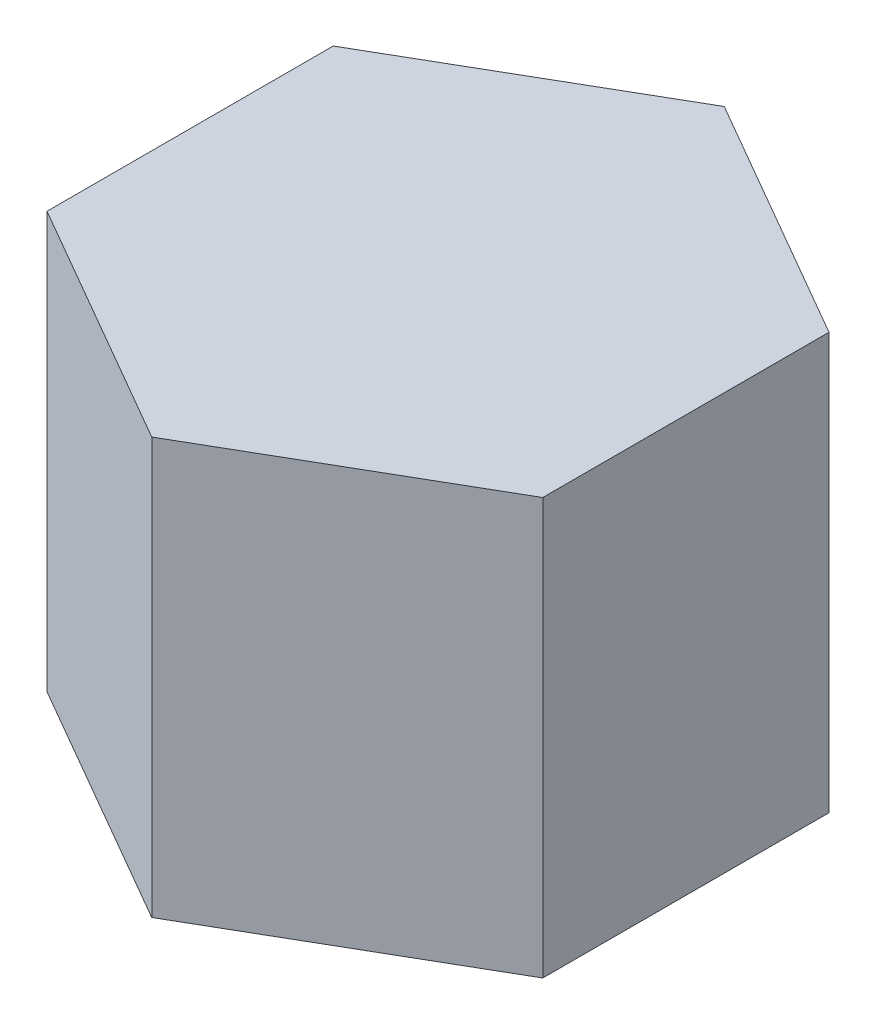
ISO-10303-21;
HEADER;
FILE_DESCRIPTION(('STEP AP214'),'2;1');
FILE_NAME('part.step','',(''),(''),'','','');
FILE_SCHEMA(('AUTOMOTIVE_DESIGN { 1 0 10303 214 1 1 1 1 }'));
ENDSEC;
DATA;
#1=APPLICATION_CONTEXT('core data for automotive mechanical design processes');
#2=APPLICATION_PROTOCOL_DEFINITION('international standard','automotive_design',2000,#1);
#3=PRODUCT_CONTEXT('',#1,'mechanical');
#4=PRODUCT('Part','Part','',(#3));
#5=PRODUCT_RELATED_PRODUCT_CATEGORY('part','',(#4));
#6=PRODUCT_DEFINITION_FORMATION('','',#4);
#7=PRODUCT_DEFINITION_CONTEXT('part definition',#1,'design');
#8=PRODUCT_DEFINITION('design','',#6,#7);
#9=PRODUCT_DEFINITION_SHAPE('','',#8);
#10=(LENGTH_UNIT() NAMED_UNIT(*) SI_UNIT(.MILLI.,.METRE.));
#11=(NAMED_UNIT(*) PLANE_ANGLE_UNIT() SI_UNIT($,.RADIAN.));
#12=(NAMED_UNIT(*) SI_UNIT($,.STERADIAN.) SOLID_ANGLE_UNIT());
#13=UNCERTAINTY_MEASURE_WITH_UNIT(LENGTH_MEASURE(1.E-05),#10,'distance_accuracy_value','');
#14=(GEOMETRIC_REPRESENTATION_CONTEXT(3) GLOBAL_UNCERTAINTY_ASSIGNED_CONTEXT((#13)) GLOBAL_UNIT_ASSIGNED_CONTEXT((#10,
#11,#12)) REPRESENTATION_CONTEXT('',''));
#15=CARTESIAN_POINT('',(0.,0.,0.));
#16=DIRECTION('',(0.,0.,1.));
#17=DIRECTION('',(1.,0.,0.));
#18=AXIS2_PLACEMENT_3D('',#15,#16,#17);
#19=CARTESIAN_POINT('',(204.339551417382,-147.556598747966,291.681971220494));
#20=DIRECTION('',(-0.500000000000096,0.,-0.866025403784383));
#21=DIRECTION('',(-0.866025403784383,0.,0.500000000000096));
#22=AXIS2_PLACEMENT_3D('',#19,#20,#21);
#23=PLANE('',#22);
#24=CARTESIAN_POINT('',(204.642660308706,-147.047793579175,291.506971220494));
#25=DIRECTION('',(-0.866025403784383,0.,0.500000000000096));
#26=VECTOR('',#25,1.);
#27=LINE('',#24,#26);
#28=CARTESIAN_POINT('',(204.642660308706,-147.047793579175,291.506971220494));
#29=VERTEX_POINT('',#28);
#30=CARTESIAN_POINT('',(204.339551417382,-147.047793579175,291.681971220494));
#31=VERTEX_POINT('',#30);
#32=EDGE_CURVE('E170',#29,#31,#27,.T.);
#33=ORIENTED_EDGE('',*,*,#32,.T.);
#34=CARTESIAN_POINT('',(204.339551417382,-147.556598747966,291.681971220494));
#35=DIRECTION('',(0.,1.,0.));
#36=VECTOR('',#35,1.);
#37=LINE('',#34,#36);
#38=CARTESIAN_POINT('',(204.339551417382,-147.556598747966,291.681971220494));
#39=VERTEX_POINT('',#38);
#40=EDGE_CURVE('E35',#39,#31,#37,.T.);
#41=ORIENTED_EDGE('',*,*,#40,.F.);
#42=CARTESIAN_POINT('',(204.642660308706,-147.556598747966,291.506971220494));
#43=DIRECTION('',(-0.866025403784383,0.,0.500000000000096));
#44=VECTOR('',#43,1.);
#45=LINE('',#42,#44);
#46=CARTESIAN_POINT('',(204.642660308706,-147.556598747966,291.506971220494));
#47=VERTEX_POINT('',#46);
#48=EDGE_CURVE('E159',#47,#39,#45,.T.);
#49=ORIENTED_EDGE('',*,*,#48,.F.);
#50=CARTESIAN_POINT('',(204.642660308706,-147.556598747966,291.506971220494));
#51=DIRECTION('',(0.,1.,0.));
#52=VECTOR('',#51,1.);
#53=LINE('',#50,#52);
#54=EDGE_CURVE('E10',#47,#29,#53,.T.);
#55=ORIENTED_EDGE('',*,*,#54,.T.);
#56=EDGE_LOOP('',(#33,#41,#49,#55));
#57=FACE_BOUND('',#56,.T.);
#58=ADVANCED_FACE('F16',(#57),#23,.F.);
#59=CARTESIAN_POINT('',(204.642660308706,-147.556598747966,291.594471220494));
#60=DIRECTION('',(-1.,0.,0.));
#61=DIRECTION('',(0.,-1.,0.));
#62=AXIS2_PLACEMENT_3D('',#59,#60,#61);
#63=PLANE('',#62);
#64=CARTESIAN_POINT('',(204.642660308706,-147.047793579175,291.156971220494));
#65=DIRECTION('',(0.,0.,1.));
#66=VECTOR('',#65,1.);
#67=LINE('',#64,#66);
#68=CARTESIAN_POINT('',(204.642660308706,-147.047793579175,291.156971220494));
#69=VERTEX_POINT('',#68);
#70=EDGE_CURVE('E167',#69,#29,#67,.T.);
#71=ORIENTED_EDGE('',*,*,#70,.T.);
#72=ORIENTED_EDGE('',*,*,#54,.F.);
#73=CARTESIAN_POINT('',(204.642660308706,-147.556598747966,291.156971220494));
#74=DIRECTION('',(0.,0.,1.));
#75=VECTOR('',#74,1.);
#76=LINE('',#73,#75);
#77=CARTESIAN_POINT('',(204.642660308706,-147.556598747966,291.156971220494));
#78=VERTEX_POINT('',#77);
#79=EDGE_CURVE('E156',#78,#47,#76,.T.);
#80=ORIENTED_EDGE('',*,*,#79,.F.);
#81=CARTESIAN_POINT('',(204.642660308706,-147.556598747966,291.156971220494));
#82=DIRECTION('',(0.,1.,0.));
#83=VECTOR('',#82,1.);
#84=LINE('',#81,#83);
#85=EDGE_CURVE('E27',#78,#69,#84,.T.);
#86=ORIENTED_EDGE('',*,*,#85,.T.);
#87=EDGE_LOOP('',(#71,#72,#80,#86));
#88=FACE_BOUND('',#87,.T.);
#89=ADVANCED_FACE('F189',(#88),#63,.F.);
#90=CARTESIAN_POINT('',(204.642660308706,-147.556598747966,291.156971220494));
#91=DIRECTION('',(-0.500000000000062,0.,0.866025403784403));
#92=DIRECTION('',(0.866025403784403,0.,0.500000000000062));
#93=AXIS2_PLACEMENT_3D('',#90,#91,#92);
#94=PLANE('',#93);
#95=CARTESIAN_POINT('',(204.339551417381,-147.047793579175,290.981971220494));
#96=DIRECTION('',(0.866025403784403,0.,0.500000000000062));
#97=VECTOR('',#96,1.);
#98=LINE('',#95,#97);
#99=CARTESIAN_POINT('',(204.339551417382,-147.047793579175,290.981971220494));
#100=VERTEX_POINT('',#99);
#101=EDGE_CURVE('E163',#100,#69,#98,.T.);
#102=ORIENTED_EDGE('',*,*,#101,.T.);
#103=ORIENTED_EDGE('',*,*,#85,.F.);
#104=CARTESIAN_POINT('',(204.339551417381,-147.556598747966,290.981971220494));
#105=DIRECTION('',(0.866025403784403,0.,0.500000000000062));
#106=VECTOR('',#105,1.);
#107=LINE('',#104,#106);
#108=CARTESIAN_POINT('',(204.339551417382,-147.556598747966,290.981971220494));
#109=VERTEX_POINT('',#108);
#110=EDGE_CURVE('E106',#109,#78,#107,.T.);
#111=ORIENTED_EDGE('',*,*,#110,.F.);
#112=CARTESIAN_POINT('',(204.339551417381,-147.556598747966,290.981971220494));
#113=DIRECTION('',(0.,1.,0.));
#114=VECTOR('',#113,1.);
#115=LINE('',#112,#114);
#116=EDGE_CURVE('E94',#109,#100,#115,.T.);
#117=ORIENTED_EDGE('',*,*,#116,.T.);
#118=EDGE_LOOP('',(#102,#103,#111,#117));
#119=FACE_BOUND('',#118,.T.);
#120=ADVANCED_FACE('F198',(#119),#94,.F.);
#121=CARTESIAN_POINT('',(204.339551417382,-147.556598747966,290.981971220494));
#122=DIRECTION('',(0.500000000000062,0.,0.866025403784403));
#123=DIRECTION('',(0.866025403784403,0.,-0.500000000000062));
#124=AXIS2_PLACEMENT_3D('',#121,#122,#123);
#125=PLANE('',#124);
#126=CARTESIAN_POINT('',(204.036442526057,-147.047793579175,291.156971220494));
#127=DIRECTION('',(0.866025403784403,0.,-0.500000000000062));
#128=VECTOR('',#127,1.);
#129=LINE('',#126,#128);
#130=CARTESIAN_POINT('',(204.036442526057,-147.047793579175,291.156971220494));
#131=VERTEX_POINT('',#130);
#132=EDGE_CURVE('E162',#131,#100,#129,.T.);
#133=ORIENTED_EDGE('',*,*,#132,.T.);
#134=ORIENTED_EDGE('',*,*,#116,.F.);
#135=CARTESIAN_POINT('',(204.036442526057,-147.556598747966,291.156971220494));
#136=DIRECTION('',(0.866025403784403,0.,-0.500000000000062));
#137=VECTOR('',#136,1.);
#138=LINE('',#135,#137);
#139=CARTESIAN_POINT('',(204.036442526057,-147.556598747966,291.156971220494));
#140=VERTEX_POINT('',#139);
#141=EDGE_CURVE('E98',#140,#109,#138,.T.);
#142=ORIENTED_EDGE('',*,*,#141,.F.);
#143=CARTESIAN_POINT('',(204.036442526057,-147.556598747966,291.156971220494));
#144=DIRECTION('',(0.,1.,0.));
#145=VECTOR('',#144,1.);
#146=LINE('',#143,#145);
#147=EDGE_CURVE('E79',#140,#131,#146,.T.);
#148=ORIENTED_EDGE('',*,*,#147,.T.);
#149=EDGE_LOOP('',(#133,#134,#142,#148));
#150=FACE_BOUND('',#149,.T.);
#151=ADVANCED_FACE('F100',(#150),#125,.F.);
#152=CARTESIAN_POINT('',(204.036442526057,-147.556598747966,291.594471220494));
#153=DIRECTION('',(1.,0.,0.));
#154=DIRECTION('',(0.,1.,0.));
#155=AXIS2_PLACEMENT_3D('',#152,#153,#154);
#156=PLANE('',#155);
#157=CARTESIAN_POINT('',(204.036442526057,-147.047793579175,291.506971220494));
#158=DIRECTION('',(0.,0.,-1.));
#159=VECTOR('',#158,1.);
#160=LINE('',#157,#159);
#161=CARTESIAN_POINT('',(204.036442526057,-147.047793579175,291.506971220494));
#162=VERTEX_POINT('',#161);
#163=EDGE_CURVE('E88',#162,#131,#160,.T.);
#164=ORIENTED_EDGE('',*,*,#163,.T.);
#165=ORIENTED_EDGE('',*,*,#147,.F.);
#166=CARTESIAN_POINT('',(204.036442526057,-147.556598747966,291.506971220494));
#167=DIRECTION('',(0.,0.,-1.));
#168=VECTOR('',#167,1.);
#169=LINE('',#166,#168);
#170=CARTESIAN_POINT('',(204.036442526057,-147.556598747966,291.506971220494));
#171=VERTEX_POINT('',#170);
#172=EDGE_CURVE('E84',#171,#140,#169,.T.);
#173=ORIENTED_EDGE('',*,*,#172,.F.);
#174=CARTESIAN_POINT('',(204.036442526057,-147.556598747966,291.506971220494));
#175=DIRECTION('',(0.,1.,0.));
#176=VECTOR('',#175,1.);
#177=LINE('',#174,#176);
#178=EDGE_CURVE('E58',#171,#162,#177,.T.);
#179=ORIENTED_EDGE('',*,*,#178,.T.);
#180=EDGE_LOOP('',(#164,#165,#173,#179));
#181=FACE_BOUND('',#180,.T.);
#182=ADVANCED_FACE('F82',(#181),#156,.F.);
#183=CARTESIAN_POINT('',(204.036442526057,-147.556598747966,291.506971220494));
#184=DIRECTION('',(0.500000000000062,0.,-0.866025403784403));
#185=DIRECTION('',(-0.866025403784403,0.,-0.500000000000062));
#186=AXIS2_PLACEMENT_3D('',#183,#184,#185);
#187=PLANE('',#186);
#188=CARTESIAN_POINT('',(204.339551417382,-147.047793579175,291.681971220494));
#189=DIRECTION('',(-0.866025403784403,0.,-0.500000000000062));
#190=VECTOR('',#189,1.);
#191=LINE('',#188,#190);
#192=EDGE_CURVE('E160',#31,#162,#191,.T.);
#193=ORIENTED_EDGE('',*,*,#192,.T.);
#194=ORIENTED_EDGE('',*,*,#178,.F.);
#195=CARTESIAN_POINT('',(204.339551417382,-147.556598747966,291.681971220494));
#196=DIRECTION('',(-0.866025403784403,0.,-0.500000000000062));
#197=VECTOR('',#196,1.);
#198=LINE('',#195,#197);
#199=EDGE_CURVE('E112',#39,#171,#198,.T.);
#200=ORIENTED_EDGE('',*,*,#199,.F.);
#201=ORIENTED_EDGE('',*,*,#40,.T.);
#202=EDGE_LOOP('',(#193,#194,#200,#201));
#203=FACE_BOUND('',#202,.T.);
#204=ADVANCED_FACE('F131',(#203),#187,.F.);
#205=CARTESIAN_POINT('',(206.491105863044,-147.556598747966,291.594471220494));
#206=DIRECTION('',(0.,1.,0.));
#207=DIRECTION('',(-1.,0.,0.));
#208=AXIS2_PLACEMENT_3D('',#205,#206,#207);
#209=PLANE('',#208);
#210=ORIENTED_EDGE('',*,*,#48,.T.);
#211=ORIENTED_EDGE('',*,*,#199,.T.);
#212=ORIENTED_EDGE('',*,*,#172,.T.);
#213=ORIENTED_EDGE('',*,*,#141,.T.);
#214=ORIENTED_EDGE('',*,*,#110,.T.);
#215=ORIENTED_EDGE('',*,*,#79,.T.);
#216=EDGE_LOOP('',(#210,#211,#212,#213,#214,#215));
#217=FACE_BOUND('',#216,.T.);
#218=ADVANCED_FACE('F111',(#217),#209,.F.);
#219=CARTESIAN_POINT('',(206.491105863044,-147.047793579175,291.594471220494));
#220=DIRECTION('',(0.,1.,0.));
#221=DIRECTION('',(-1.,0.,0.));
#222=AXIS2_PLACEMENT_3D('',#219,#220,#221);
#223=PLANE('',#222);
#224=ORIENTED_EDGE('',*,*,#32,.F.);
#225=ORIENTED_EDGE('',*,*,#70,.F.);
#226=ORIENTED_EDGE('',*,*,#101,.F.);
#227=ORIENTED_EDGE('',*,*,#132,.F.);
#228=ORIENTED_EDGE('',*,*,#163,.F.);
#229=ORIENTED_EDGE('',*,*,#192,.F.);
#230=EDGE_LOOP('',(#224,#225,#226,#227,#228,#229));
#231=FACE_BOUND('',#230,.T.);
#232=ADVANCED_FACE('F130',(#231),#223,.T.);
#233=CLOSED_SHELL('',(#58,#89,#120,#151,#182,#204,#218,#232));
#234=MANIFOLD_SOLID_BREP('B1',#233);
#235=ADVANCED_BREP_SHAPE_REPRESENTATION('',(#18,#234),#14);
#236=SHAPE_DEFINITION_REPRESENTATION(#9,#235);
ENDSEC;
END-ISO-10303-21;
